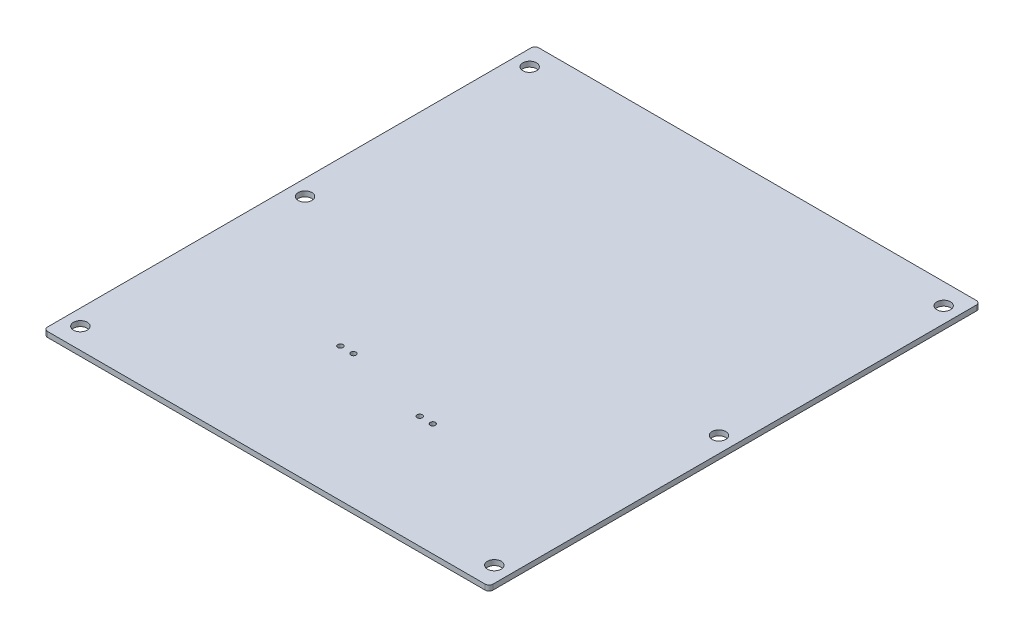
ISO-10303-21;
HEADER;
FILE_DESCRIPTION(('STEP AP214'),'2;1');
FILE_NAME('part.step','',(''),(''),'','','');
FILE_SCHEMA(('AUTOMOTIVE_DESIGN { 1 0 10303 214 1 1 1 1 }'));
ENDSEC;
DATA;
#1=APPLICATION_CONTEXT('core data for automotive mechanical design processes');
#2=APPLICATION_PROTOCOL_DEFINITION('international standard','automotive_design',2000,#1);
#3=PRODUCT_CONTEXT('',#1,'mechanical');
#4=PRODUCT('Part','Part','',(#3));
#5=PRODUCT_RELATED_PRODUCT_CATEGORY('part','',(#4));
#6=PRODUCT_DEFINITION_FORMATION('','',#4);
#7=PRODUCT_DEFINITION_CONTEXT('part definition',#1,'design');
#8=PRODUCT_DEFINITION('design','',#6,#7);
#9=PRODUCT_DEFINITION_SHAPE('','',#8);
#10=(LENGTH_UNIT() NAMED_UNIT(*) SI_UNIT(.MILLI.,.METRE.));
#11=(NAMED_UNIT(*) PLANE_ANGLE_UNIT() SI_UNIT($,.RADIAN.));
#12=(NAMED_UNIT(*) SI_UNIT($,.STERADIAN.) SOLID_ANGLE_UNIT());
#13=UNCERTAINTY_MEASURE_WITH_UNIT(LENGTH_MEASURE(1.E-05),#10,'distance_accuracy_value','');
#14=(GEOMETRIC_REPRESENTATION_CONTEXT(3) GLOBAL_UNCERTAINTY_ASSIGNED_CONTEXT((#13)) GLOBAL_UNIT_ASSIGNED_CONTEXT((#10,
#11,#12)) REPRESENTATION_CONTEXT('',''));
#15=CARTESIAN_POINT('',(0.,0.,0.));
#16=DIRECTION('',(0.,0.,1.));
#17=DIRECTION('',(1.,0.,0.));
#18=AXIS2_PLACEMENT_3D('',#15,#16,#17);
#19=CARTESIAN_POINT('',(319.226041148513,4.,-107.292047617403));
#20=DIRECTION('',(0.,1.,0.));
#21=DIRECTION('',(0.,0.,1.));
#22=AXIS2_PLACEMENT_3D('',#19,#20,#21);
#23=PLANE('',#22);
#24=CARTESIAN_POINT('',(517.330184072689,4.,178.737413059714));
#25=DIRECTION('',(0.,1.,0.));
#26=DIRECTION('',(0.,0.,-1.));
#27=AXIS2_PLACEMENT_3D('',#24,#25,#26);
#28=CIRCLE('',#27,2.);
#29=CARTESIAN_POINT('',(517.330184072689,4.,176.737413059714));
#30=VERTEX_POINT('',#29);
#31=EDGE_CURVE('E224',#30,#30,#28,.T.);
#32=ORIENTED_EDGE('',*,*,#31,.F.);
#33=EDGE_LOOP('',(#32));
#34=FACE_BOUND('',#33,.T.);
#35=CARTESIAN_POINT('',(450.618955235083,4.,162.614244131011));
#36=DIRECTION('',(0.,1.,0.));
#37=DIRECTION('',(0.,0.,1.));
#38=AXIS2_PLACEMENT_3D('',#35,#36,#37);
#39=CIRCLE('',#38,2.);
#40=CARTESIAN_POINT('',(450.618955235083,4.,164.614244131011));
#41=VERTEX_POINT('',#40);
#42=EDGE_CURVE('E212',#41,#41,#39,.T.);
#43=ORIENTED_EDGE('',*,*,#42,.F.);
#44=EDGE_LOOP('',(#43));
#45=FACE_BOUND('',#44,.T.);
#46=CARTESIAN_POINT('',(328.226041148513,4.,248.707952382597));
#47=DIRECTION('',(0.,1.,0.));
#48=DIRECTION('',(0.,0.,-1.));
#49=AXIS2_PLACEMENT_3D('',#46,#47,#48);
#50=CIRCLE('',#49,5.25);
#51=CARTESIAN_POINT('',(328.226041148513,4.,243.457952382597));
#52=VERTEX_POINT('',#51);
#53=EDGE_CURVE('E200',#52,#52,#50,.T.);
#54=ORIENTED_EDGE('',*,*,#53,.F.);
#55=EDGE_LOOP('',(#54));
#56=FACE_BOUND('',#55,.T.);
#57=CARTESIAN_POINT('',(644.226041148513,4.,-94.2920476174031));
#58=DIRECTION('',(0.,1.,0.));
#59=DIRECTION('',(0.,0.,-1.));
#60=AXIS2_PLACEMENT_3D('',#57,#58,#59);
#61=CIRCLE('',#60,5.24999999999995);
#62=CARTESIAN_POINT('',(644.226041148513,4.,-99.542047617403));
#63=VERTEX_POINT('',#62);
#64=EDGE_CURVE('E188',#63,#63,#61,.T.);
#65=ORIENTED_EDGE('',*,*,#64,.F.);
#66=EDGE_LOOP('',(#65));
#67=FACE_BOUND('',#66,.T.);
#68=CARTESIAN_POINT('',(644.226041148513,4.,77.2079523825969));
#69=DIRECTION('',(0.,1.,0.));
#70=DIRECTION('',(0.,0.,-1.));
#71=AXIS2_PLACEMENT_3D('',#68,#69,#70);
#72=CIRCLE('',#71,5.24999999999995);
#73=CARTESIAN_POINT('',(644.226041148513,4.,71.9579523825969));
#74=VERTEX_POINT('',#73);
#75=EDGE_CURVE('E134',#74,#74,#72,.T.);
#76=ORIENTED_EDGE('',*,*,#75,.F.);
#77=EDGE_LOOP('',(#76));
#78=FACE_BOUND('',#77,.T.);
#79=CARTESIAN_POINT('',(319.226041148513,4.,-107.292047617403));
#80=DIRECTION('',(0.,1.,0.));
#81=DIRECTION('',(0.,0.,1.));
#82=AXIS2_PLACEMENT_3D('',#79,#80,#81);
#83=CIRCLE('',#82,3.);
#84=CARTESIAN_POINT('',(319.226041148513,4.,-110.292047617403));
#85=VERTEX_POINT('',#84);
#86=CARTESIAN_POINT('',(316.226041148513,4.,-107.292047617403));
#87=VERTEX_POINT('',#86);
#88=EDGE_CURVE('E145',#85,#87,#83,.T.);
#89=ORIENTED_EDGE('',*,*,#88,.T.);
#90=DIRECTION('',(0.,0.,1.));
#91=VECTOR('',#90,1.);
#92=CARTESIAN_POINT('',(316.226041148513,4.,-107.292047617403));
#93=LINE('',#92,#91);
#94=CARTESIAN_POINT('',(316.226041148513,4.,261.707952382597));
#95=VERTEX_POINT('',#94);
#96=EDGE_CURVE('E93',#87,#95,#93,.T.);
#97=ORIENTED_EDGE('',*,*,#96,.T.);
#98=CARTESIAN_POINT('',(319.226041148513,4.,261.707952382597));
#99=DIRECTION('',(0.,1.,0.));
#100=DIRECTION('',(0.,0.,1.));
#101=AXIS2_PLACEMENT_3D('',#98,#99,#100);
#102=CIRCLE('',#101,3.);
#103=CARTESIAN_POINT('',(319.226041148513,4.,264.707952382597));
#104=VERTEX_POINT('',#103);
#105=EDGE_CURVE('E160',#95,#104,#102,.T.);
#106=ORIENTED_EDGE('',*,*,#105,.T.);
#107=DIRECTION('',(1.,0.,0.));
#108=VECTOR('',#107,1.);
#109=CARTESIAN_POINT('',(319.226041148513,4.,264.707952382597));
#110=LINE('',#109,#108);
#111=CARTESIAN_POINT('',(653.226041148513,4.,264.707952382597));
#112=VERTEX_POINT('',#111);
#113=EDGE_CURVE('E173',#104,#112,#110,.T.);
#114=ORIENTED_EDGE('',*,*,#113,.T.);
#115=CARTESIAN_POINT('',(653.226041148513,4.,261.707952382597));
#116=DIRECTION('',(0.,1.,0.));
#117=DIRECTION('',(0.,0.,1.));
#118=AXIS2_PLACEMENT_3D('',#115,#116,#117);
#119=CIRCLE('',#118,3.);
#120=CARTESIAN_POINT('',(656.226041148513,4.,261.707952382597));
#121=VERTEX_POINT('',#120);
#122=EDGE_CURVE('E112',#112,#121,#119,.T.);
#123=ORIENTED_EDGE('',*,*,#122,.T.);
#124=DIRECTION('',(0.,0.,-1.));
#125=VECTOR('',#124,1.);
#126=CARTESIAN_POINT('',(656.226041148513,4.,261.707952382597));
#127=LINE('',#126,#125);
#128=CARTESIAN_POINT('',(656.226041148513,4.,-107.292047617403));
#129=VERTEX_POINT('',#128);
#130=EDGE_CURVE('E106',#121,#129,#127,.T.);
#131=ORIENTED_EDGE('',*,*,#130,.T.);
#132=CARTESIAN_POINT('',(653.226041148513,4.,-107.292047617403));
#133=DIRECTION('',(0.,1.,0.));
#134=DIRECTION('',(0.,0.,1.));
#135=AXIS2_PLACEMENT_3D('',#132,#133,#134);
#136=CIRCLE('',#135,3.);
#137=CARTESIAN_POINT('',(653.226041148513,4.,-110.292047617403));
#138=VERTEX_POINT('',#137);
#139=EDGE_CURVE('E110',#129,#138,#136,.T.);
#140=ORIENTED_EDGE('',*,*,#139,.T.);
#141=DIRECTION('',(-1.,0.,0.));
#142=VECTOR('',#141,1.);
#143=CARTESIAN_POINT('',(653.226041148513,4.,-110.292047617403));
#144=LINE('',#143,#142);
#145=EDGE_CURVE('E50',#138,#85,#144,.T.);
#146=ORIENTED_EDGE('',*,*,#145,.T.);
#147=EDGE_LOOP('',(#89,#97,#106,#114,#123,#131,#140,#146));
#148=FACE_BOUND('',#147,.T.);
#149=CARTESIAN_POINT('',(328.226041148513,4.,77.207952382597));
#150=DIRECTION('',(0.,1.,0.));
#151=DIRECTION('',(0.,0.,-1.));
#152=AXIS2_PLACEMENT_3D('',#149,#150,#151);
#153=CIRCLE('',#152,5.25);
#154=CARTESIAN_POINT('',(328.226041148513,4.,71.957952382597));
#155=VERTEX_POINT('',#154);
#156=EDGE_CURVE('E182',#155,#155,#153,.T.);
#157=ORIENTED_EDGE('',*,*,#156,.F.);
#158=EDGE_LOOP('',(#157));
#159=FACE_BOUND('',#158,.T.);
#160=CARTESIAN_POINT('',(328.226041148513,4.,-94.2920476174031));
#161=DIRECTION('',(0.,1.,0.));
#162=DIRECTION('',(0.,0.,-1.));
#163=AXIS2_PLACEMENT_3D('',#160,#161,#162);
#164=CIRCLE('',#163,5.25);
#165=CARTESIAN_POINT('',(328.226041148513,4.,-99.5420476174031));
#166=VERTEX_POINT('',#165);
#167=EDGE_CURVE('E194',#166,#166,#164,.T.);
#168=ORIENTED_EDGE('',*,*,#167,.F.);
#169=EDGE_LOOP('',(#168));
#170=FACE_BOUND('',#169,.T.);
#171=CARTESIAN_POINT('',(644.226041148513,4.,248.707952382597));
#172=DIRECTION('',(0.,1.,0.));
#173=DIRECTION('',(0.,0.,-1.));
#174=AXIS2_PLACEMENT_3D('',#171,#172,#173);
#175=CIRCLE('',#174,5.24999999999995);
#176=CARTESIAN_POINT('',(644.226041148513,4.,243.457952382597));
#177=VERTEX_POINT('',#176);
#178=EDGE_CURVE('E206',#177,#177,#175,.T.);
#179=ORIENTED_EDGE('',*,*,#178,.F.);
#180=EDGE_LOOP('',(#179));
#181=FACE_BOUND('',#180,.T.);
#182=CARTESIAN_POINT('',(440.618955235083,4.,162.614244131011));
#183=DIRECTION('',(0.,1.,0.));
#184=DIRECTION('',(0.,0.,1.));
#185=AXIS2_PLACEMENT_3D('',#182,#183,#184);
#186=CIRCLE('',#185,2.);
#187=CARTESIAN_POINT('',(440.618955235083,4.,164.614244131011));
#188=VERTEX_POINT('',#187);
#189=EDGE_CURVE('E218',#188,#188,#186,.T.);
#190=ORIENTED_EDGE('',*,*,#189,.F.);
#191=EDGE_LOOP('',(#190));
#192=FACE_BOUND('',#191,.T.);
#193=CARTESIAN_POINT('',(527.330184072689,4.,178.737413059714));
#194=DIRECTION('',(0.,1.,0.));
#195=DIRECTION('',(0.,0.,-1.));
#196=AXIS2_PLACEMENT_3D('',#193,#194,#195);
#197=CIRCLE('',#196,2.);
#198=CARTESIAN_POINT('',(527.330184072689,4.,176.737413059714));
#199=VERTEX_POINT('',#198);
#200=EDGE_CURVE('E230',#199,#199,#197,.T.);
#201=ORIENTED_EDGE('',*,*,#200,.F.);
#202=EDGE_LOOP('',(#201));
#203=FACE_BOUND('',#202,.T.);
#204=ADVANCED_FACE('F33',(#34,#45,#56,#67,#78,#148,#159,#170,#181,#192,#203),#23,.T.);
#205=CARTESIAN_POINT('',(319.226041148513,0.,-107.292047617403));
#206=DIRECTION('',(0.,1.,0.));
#207=DIRECTION('',(0.,0.,1.));
#208=AXIS2_PLACEMENT_3D('',#205,#206,#207);
#209=PLANE('',#208);
#210=CARTESIAN_POINT('',(319.226041148513,0.,-107.292047617403));
#211=DIRECTION('',(0.,1.,0.));
#212=DIRECTION('',(0.,0.,1.));
#213=AXIS2_PLACEMENT_3D('',#210,#211,#212);
#214=CIRCLE('',#213,3.);
#215=CARTESIAN_POINT('',(319.226041148513,0.,-110.292047617403));
#216=VERTEX_POINT('',#215);
#217=CARTESIAN_POINT('',(316.226041148513,0.,-107.292047617403));
#218=VERTEX_POINT('',#217);
#219=EDGE_CURVE('E130',#216,#218,#214,.T.);
#220=ORIENTED_EDGE('',*,*,#219,.F.);
#221=DIRECTION('',(-1.,0.,0.));
#222=VECTOR('',#221,1.);
#223=CARTESIAN_POINT('',(653.226041148513,0.,-110.292047617403));
#224=LINE('',#223,#222);
#225=CARTESIAN_POINT('',(653.226041148513,0.,-110.292047617403));
#226=VERTEX_POINT('',#225);
#227=EDGE_CURVE('E85',#226,#216,#224,.T.);
#228=ORIENTED_EDGE('',*,*,#227,.F.);
#229=CARTESIAN_POINT('',(653.226041148513,0.,-107.292047617403));
#230=DIRECTION('',(0.,1.,0.));
#231=DIRECTION('',(0.,0.,1.));
#232=AXIS2_PLACEMENT_3D('',#229,#230,#231);
#233=CIRCLE('',#232,3.);
#234=CARTESIAN_POINT('',(656.226041148513,0.,-107.292047617403));
#235=VERTEX_POINT('',#234);
#236=EDGE_CURVE('E79',#235,#226,#233,.T.);
#237=ORIENTED_EDGE('',*,*,#236,.F.);
#238=DIRECTION('',(0.,0.,-1.));
#239=VECTOR('',#238,1.);
#240=CARTESIAN_POINT('',(656.226041148513,0.,261.707952382597));
#241=LINE('',#240,#239);
#242=CARTESIAN_POINT('',(656.226041148513,0.,261.707952382597));
#243=VERTEX_POINT('',#242);
#244=EDGE_CURVE('E120',#243,#235,#241,.T.);
#245=ORIENTED_EDGE('',*,*,#244,.F.);
#246=CARTESIAN_POINT('',(653.226041148513,0.,261.707952382597));
#247=DIRECTION('',(0.,1.,0.));
#248=DIRECTION('',(0.,0.,1.));
#249=AXIS2_PLACEMENT_3D('',#246,#247,#248);
#250=CIRCLE('',#249,3.);
#251=CARTESIAN_POINT('',(653.226041148513,0.,264.707952382597));
#252=VERTEX_POINT('',#251);
#253=EDGE_CURVE('E140',#252,#243,#250,.T.);
#254=ORIENTED_EDGE('',*,*,#253,.F.);
#255=DIRECTION('',(1.,0.,0.));
#256=VECTOR('',#255,1.);
#257=CARTESIAN_POINT('',(319.226041148513,0.,264.707952382597));
#258=LINE('',#257,#256);
#259=CARTESIAN_POINT('',(319.226041148513,0.,264.707952382597));
#260=VERTEX_POINT('',#259);
#261=EDGE_CURVE('E138',#260,#252,#258,.T.);
#262=ORIENTED_EDGE('',*,*,#261,.F.);
#263=CARTESIAN_POINT('',(319.226041148513,0.,261.707952382597));
#264=DIRECTION('',(0.,1.,0.));
#265=DIRECTION('',(0.,0.,1.));
#266=AXIS2_PLACEMENT_3D('',#263,#264,#265);
#267=CIRCLE('',#266,3.);
#268=CARTESIAN_POINT('',(316.226041148513,0.,261.707952382597));
#269=VERTEX_POINT('',#268);
#270=EDGE_CURVE('E136',#269,#260,#267,.T.);
#271=ORIENTED_EDGE('',*,*,#270,.F.);
#272=DIRECTION('',(0.,0.,1.));
#273=VECTOR('',#272,1.);
#274=CARTESIAN_POINT('',(316.226041148513,0.,-107.292047617403));
#275=LINE('',#274,#273);
#276=EDGE_CURVE('E133',#218,#269,#275,.T.);
#277=ORIENTED_EDGE('',*,*,#276,.F.);
#278=EDGE_LOOP('',(#220,#228,#237,#245,#254,#262,#271,#277));
#279=FACE_BOUND('',#278,.T.);
#280=CARTESIAN_POINT('',(644.226041148513,0.,77.2079523825969));
#281=DIRECTION('',(0.,1.,0.));
#282=DIRECTION('',(0.,0.,-1.));
#283=AXIS2_PLACEMENT_3D('',#280,#281,#282);
#284=CIRCLE('',#283,5.24999999999995);
#285=CARTESIAN_POINT('',(644.226041148513,0.,71.9579523825969));
#286=VERTEX_POINT('',#285);
#287=EDGE_CURVE('E179',#286,#286,#284,.T.);
#288=ORIENTED_EDGE('',*,*,#287,.T.);
#289=EDGE_LOOP('',(#288));
#290=FACE_BOUND('',#289,.T.);
#291=CARTESIAN_POINT('',(328.226041148513,0.,77.207952382597));
#292=DIRECTION('',(0.,1.,0.));
#293=DIRECTION('',(0.,0.,-1.));
#294=AXIS2_PLACEMENT_3D('',#291,#292,#293);
#295=CIRCLE('',#294,5.25);
#296=CARTESIAN_POINT('',(328.226041148513,0.,71.957952382597));
#297=VERTEX_POINT('',#296);
#298=EDGE_CURVE('E185',#297,#297,#295,.T.);
#299=ORIENTED_EDGE('',*,*,#298,.T.);
#300=EDGE_LOOP('',(#299));
#301=FACE_BOUND('',#300,.T.);
#302=CARTESIAN_POINT('',(644.226041148513,0.,-94.2920476174031));
#303=DIRECTION('',(0.,1.,0.));
#304=DIRECTION('',(0.,0.,-1.));
#305=AXIS2_PLACEMENT_3D('',#302,#303,#304);
#306=CIRCLE('',#305,5.24999999999995);
#307=CARTESIAN_POINT('',(644.226041148513,0.,-99.542047617403));
#308=VERTEX_POINT('',#307);
#309=EDGE_CURVE('E191',#308,#308,#306,.T.);
#310=ORIENTED_EDGE('',*,*,#309,.T.);
#311=EDGE_LOOP('',(#310));
#312=FACE_BOUND('',#311,.T.);
#313=CARTESIAN_POINT('',(328.226041148513,0.,-94.2920476174031));
#314=DIRECTION('',(0.,1.,0.));
#315=DIRECTION('',(0.,0.,-1.));
#316=AXIS2_PLACEMENT_3D('',#313,#314,#315);
#317=CIRCLE('',#316,5.25);
#318=CARTESIAN_POINT('',(328.226041148513,0.,-99.5420476174031));
#319=VERTEX_POINT('',#318);
#320=EDGE_CURVE('E197',#319,#319,#317,.T.);
#321=ORIENTED_EDGE('',*,*,#320,.T.);
#322=EDGE_LOOP('',(#321));
#323=FACE_BOUND('',#322,.T.);
#324=CARTESIAN_POINT('',(328.226041148513,0.,248.707952382597));
#325=DIRECTION('',(0.,1.,0.));
#326=DIRECTION('',(0.,0.,-1.));
#327=AXIS2_PLACEMENT_3D('',#324,#325,#326);
#328=CIRCLE('',#327,5.25);
#329=CARTESIAN_POINT('',(328.226041148513,0.,243.457952382597));
#330=VERTEX_POINT('',#329);
#331=EDGE_CURVE('E203',#330,#330,#328,.T.);
#332=ORIENTED_EDGE('',*,*,#331,.T.);
#333=EDGE_LOOP('',(#332));
#334=FACE_BOUND('',#333,.T.);
#335=CARTESIAN_POINT('',(644.226041148513,0.,248.707952382597));
#336=DIRECTION('',(0.,1.,0.));
#337=DIRECTION('',(0.,0.,-1.));
#338=AXIS2_PLACEMENT_3D('',#335,#336,#337);
#339=CIRCLE('',#338,5.24999999999995);
#340=CARTESIAN_POINT('',(644.226041148513,0.,243.457952382597));
#341=VERTEX_POINT('',#340);
#342=EDGE_CURVE('E209',#341,#341,#339,.T.);
#343=ORIENTED_EDGE('',*,*,#342,.T.);
#344=EDGE_LOOP('',(#343));
#345=FACE_BOUND('',#344,.T.);
#346=CARTESIAN_POINT('',(450.618955235083,0.,162.614244131011));
#347=DIRECTION('',(0.,1.,0.));
#348=DIRECTION('',(0.,0.,1.));
#349=AXIS2_PLACEMENT_3D('',#346,#347,#348);
#350=CIRCLE('',#349,2.);
#351=CARTESIAN_POINT('',(450.618955235083,0.,164.614244131011));
#352=VERTEX_POINT('',#351);
#353=EDGE_CURVE('E215',#352,#352,#350,.T.);
#354=ORIENTED_EDGE('',*,*,#353,.T.);
#355=EDGE_LOOP('',(#354));
#356=FACE_BOUND('',#355,.T.);
#357=CARTESIAN_POINT('',(440.618955235083,0.,162.614244131011));
#358=DIRECTION('',(0.,1.,0.));
#359=DIRECTION('',(0.,0.,1.));
#360=AXIS2_PLACEMENT_3D('',#357,#358,#359);
#361=CIRCLE('',#360,2.);
#362=CARTESIAN_POINT('',(440.618955235083,0.,164.614244131011));
#363=VERTEX_POINT('',#362);
#364=EDGE_CURVE('E221',#363,#363,#361,.T.);
#365=ORIENTED_EDGE('',*,*,#364,.T.);
#366=EDGE_LOOP('',(#365));
#367=FACE_BOUND('',#366,.T.);
#368=CARTESIAN_POINT('',(517.330184072689,0.,178.737413059714));
#369=DIRECTION('',(0.,1.,0.));
#370=DIRECTION('',(0.,0.,-1.));
#371=AXIS2_PLACEMENT_3D('',#368,#369,#370);
#372=CIRCLE('',#371,2.);
#373=CARTESIAN_POINT('',(517.330184072689,0.,176.737413059714));
#374=VERTEX_POINT('',#373);
#375=EDGE_CURVE('E227',#374,#374,#372,.T.);
#376=ORIENTED_EDGE('',*,*,#375,.T.);
#377=EDGE_LOOP('',(#376));
#378=FACE_BOUND('',#377,.T.);
#379=CARTESIAN_POINT('',(527.330184072689,0.,178.737413059714));
#380=DIRECTION('',(0.,1.,0.));
#381=DIRECTION('',(0.,0.,-1.));
#382=AXIS2_PLACEMENT_3D('',#379,#380,#381);
#383=CIRCLE('',#382,2.);
#384=CARTESIAN_POINT('',(527.330184072689,0.,176.737413059714));
#385=VERTEX_POINT('',#384);
#386=EDGE_CURVE('E233',#385,#385,#383,.T.);
#387=ORIENTED_EDGE('',*,*,#386,.T.);
#388=EDGE_LOOP('',(#387));
#389=FACE_BOUND('',#388,.T.);
#390=ADVANCED_FACE('F164',(#279,#290,#301,#312,#323,#334,#345,#356,#367,#378,#389),#209,.F.);
#391=CARTESIAN_POINT('',(319.226041148513,4.,-107.292047617403));
#392=DIRECTION('',(0.,-1.,0.));
#393=DIRECTION('',(0.,0.,-1.));
#394=AXIS2_PLACEMENT_3D('',#391,#392,#393);
#395=CYLINDRICAL_SURFACE('',#394,3.);
#396=ORIENTED_EDGE('',*,*,#219,.T.);
#397=DIRECTION('',(0.,-1.,0.));
#398=VECTOR('',#397,1.);
#399=CARTESIAN_POINT('',(316.226041148513,4.,-107.292047617403));
#400=LINE('',#399,#398);
#401=EDGE_CURVE('E11',#87,#218,#400,.T.);
#402=ORIENTED_EDGE('',*,*,#401,.F.);
#403=ORIENTED_EDGE('',*,*,#88,.F.);
#404=DIRECTION('',(0.,-1.,0.));
#405=VECTOR('',#404,1.);
#406=CARTESIAN_POINT('',(319.226041148513,4.,-110.292047617403));
#407=LINE('',#406,#405);
#408=EDGE_CURVE('E126',#85,#216,#407,.T.);
#409=ORIENTED_EDGE('',*,*,#408,.T.);
#410=EDGE_LOOP('',(#396,#402,#403,#409));
#411=FACE_BOUND('',#410,.T.);
#412=ADVANCED_FACE('F35',(#411),#395,.T.);
#413=CARTESIAN_POINT('',(316.226041148513,4.,-107.292047617403));
#414=DIRECTION('',(1.,0.,0.));
#415=DIRECTION('',(0.,0.,-1.));
#416=AXIS2_PLACEMENT_3D('',#413,#414,#415);
#417=PLANE('',#416);
#418=ORIENTED_EDGE('',*,*,#276,.T.);
#419=DIRECTION('',(0.,-1.,0.));
#420=VECTOR('',#419,1.);
#421=CARTESIAN_POINT('',(316.226041148513,4.,261.707952382597));
#422=LINE('',#421,#420);
#423=EDGE_CURVE('E42',#95,#269,#422,.T.);
#424=ORIENTED_EDGE('',*,*,#423,.F.);
#425=ORIENTED_EDGE('',*,*,#96,.F.);
#426=ORIENTED_EDGE('',*,*,#401,.T.);
#427=EDGE_LOOP('',(#418,#424,#425,#426));
#428=FACE_BOUND('',#427,.T.);
#429=ADVANCED_FACE('F267',(#428),#417,.F.);
#430=CARTESIAN_POINT('',(319.226041148513,4.,261.707952382597));
#431=DIRECTION('',(0.,-1.,0.));
#432=DIRECTION('',(0.,0.,-1.));
#433=AXIS2_PLACEMENT_3D('',#430,#431,#432);
#434=CYLINDRICAL_SURFACE('',#433,3.);
#435=ORIENTED_EDGE('',*,*,#270,.T.);
#436=DIRECTION('',(0.,-1.,0.));
#437=VECTOR('',#436,1.);
#438=CARTESIAN_POINT('',(319.226041148513,4.,264.707952382597));
#439=LINE('',#438,#437);
#440=EDGE_CURVE('E152',#104,#260,#439,.T.);
#441=ORIENTED_EDGE('',*,*,#440,.F.);
#442=ORIENTED_EDGE('',*,*,#105,.F.);
#443=ORIENTED_EDGE('',*,*,#423,.T.);
#444=EDGE_LOOP('',(#435,#441,#442,#443));
#445=FACE_BOUND('',#444,.T.);
#446=ADVANCED_FACE('F158',(#445),#434,.T.);
#447=CARTESIAN_POINT('',(319.226041148513,4.,264.707952382597));
#448=DIRECTION('',(0.,0.,-1.));
#449=DIRECTION('',(-1.,0.,0.));
#450=AXIS2_PLACEMENT_3D('',#447,#448,#449);
#451=PLANE('',#450);
#452=ORIENTED_EDGE('',*,*,#261,.T.);
#453=DIRECTION('',(0.,-1.,0.));
#454=VECTOR('',#453,1.);
#455=CARTESIAN_POINT('',(653.226041148513,4.,264.707952382597));
#456=LINE('',#455,#454);
#457=EDGE_CURVE('E149',#112,#252,#456,.T.);
#458=ORIENTED_EDGE('',*,*,#457,.F.);
#459=ORIENTED_EDGE('',*,*,#113,.F.);
#460=ORIENTED_EDGE('',*,*,#440,.T.);
#461=EDGE_LOOP('',(#452,#458,#459,#460));
#462=FACE_BOUND('',#461,.T.);
#463=ADVANCED_FACE('F169',(#462),#451,.F.);
#464=CARTESIAN_POINT('',(653.226041148513,4.,261.707952382597));
#465=DIRECTION('',(0.,-1.,0.));
#466=DIRECTION('',(0.,0.,-1.));
#467=AXIS2_PLACEMENT_3D('',#464,#465,#466);
#468=CYLINDRICAL_SURFACE('',#467,3.);
#469=ORIENTED_EDGE('',*,*,#253,.T.);
#470=DIRECTION('',(0.,-1.,0.));
#471=VECTOR('',#470,1.);
#472=CARTESIAN_POINT('',(656.226041148513,4.,261.707952382597));
#473=LINE('',#472,#471);
#474=EDGE_CURVE('E121',#121,#243,#473,.T.);
#475=ORIENTED_EDGE('',*,*,#474,.F.);
#476=ORIENTED_EDGE('',*,*,#122,.F.);
#477=ORIENTED_EDGE('',*,*,#457,.T.);
#478=EDGE_LOOP('',(#469,#475,#476,#477));
#479=FACE_BOUND('',#478,.T.);
#480=ADVANCED_FACE('F172',(#479),#468,.T.);
#481=CARTESIAN_POINT('',(656.226041148513,4.,261.707952382597));
#482=DIRECTION('',(-1.,0.,0.));
#483=DIRECTION('',(0.,0.,1.));
#484=AXIS2_PLACEMENT_3D('',#481,#482,#483);
#485=PLANE('',#484);
#486=ORIENTED_EDGE('',*,*,#244,.T.);
#487=DIRECTION('',(0.,-1.,0.));
#488=VECTOR('',#487,1.);
#489=CARTESIAN_POINT('',(656.226041148513,4.,-107.292047617403));
#490=LINE('',#489,#488);
#491=EDGE_CURVE('E117',#129,#235,#490,.T.);
#492=ORIENTED_EDGE('',*,*,#491,.F.);
#493=ORIENTED_EDGE('',*,*,#130,.F.);
#494=ORIENTED_EDGE('',*,*,#474,.T.);
#495=EDGE_LOOP('',(#486,#492,#493,#494));
#496=FACE_BOUND('',#495,.T.);
#497=ADVANCED_FACE('F118',(#496),#485,.F.);
#498=CARTESIAN_POINT('',(653.226041148513,4.,-107.292047617403));
#499=DIRECTION('',(0.,-1.,0.));
#500=DIRECTION('',(0.,0.,-1.));
#501=AXIS2_PLACEMENT_3D('',#498,#499,#500);
#502=CYLINDRICAL_SURFACE('',#501,3.);
#503=ORIENTED_EDGE('',*,*,#236,.T.);
#504=DIRECTION('',(0.,-1.,0.));
#505=VECTOR('',#504,1.);
#506=CARTESIAN_POINT('',(653.226041148513,4.,-110.292047617403));
#507=LINE('',#506,#505);
#508=EDGE_CURVE('E122',#138,#226,#507,.T.);
#509=ORIENTED_EDGE('',*,*,#508,.F.);
#510=ORIENTED_EDGE('',*,*,#139,.F.);
#511=ORIENTED_EDGE('',*,*,#491,.T.);
#512=EDGE_LOOP('',(#503,#509,#510,#511));
#513=FACE_BOUND('',#512,.T.);
#514=ADVANCED_FACE('F124',(#513),#502,.T.);
#515=CARTESIAN_POINT('',(653.226041148513,4.,-110.292047617403));
#516=DIRECTION('',(0.,0.,1.));
#517=DIRECTION('',(1.,0.,0.));
#518=AXIS2_PLACEMENT_3D('',#515,#516,#517);
#519=PLANE('',#518);
#520=ORIENTED_EDGE('',*,*,#227,.T.);
#521=ORIENTED_EDGE('',*,*,#408,.F.);
#522=ORIENTED_EDGE('',*,*,#145,.F.);
#523=ORIENTED_EDGE('',*,*,#508,.T.);
#524=EDGE_LOOP('',(#520,#521,#522,#523));
#525=FACE_BOUND('',#524,.T.);
#526=ADVANCED_FACE('F255',(#525),#519,.F.);
#527=CARTESIAN_POINT('',(644.226041148513,4.,77.2079523825969));
#528=DIRECTION('',(0.,-1.,0.));
#529=DIRECTION('',(0.,0.,-1.));
#530=AXIS2_PLACEMENT_3D('',#527,#528,#529);
#531=CYLINDRICAL_SURFACE('',#530,5.24999999999995);
#532=ORIENTED_EDGE('',*,*,#75,.T.);
#533=EDGE_LOOP('',(#532));
#534=FACE_BOUND('',#533,.T.);
#535=ORIENTED_EDGE('',*,*,#287,.F.);
#536=EDGE_LOOP('',(#535));
#537=FACE_BOUND('',#536,.T.);
#538=ADVANCED_FACE('F252',(#534,#537),#531,.F.);
#539=CARTESIAN_POINT('',(328.226041148513,4.,77.207952382597));
#540=DIRECTION('',(0.,-1.,0.));
#541=DIRECTION('',(0.,0.,-1.));
#542=AXIS2_PLACEMENT_3D('',#539,#540,#541);
#543=CYLINDRICAL_SURFACE('',#542,5.25);
#544=ORIENTED_EDGE('',*,*,#156,.T.);
#545=EDGE_LOOP('',(#544));
#546=FACE_BOUND('',#545,.T.);
#547=ORIENTED_EDGE('',*,*,#298,.F.);
#548=EDGE_LOOP('',(#547));
#549=FACE_BOUND('',#548,.T.);
#550=ADVANCED_FACE('F331',(#546,#549),#543,.F.);
#551=CARTESIAN_POINT('',(644.226041148513,4.,-94.2920476174031));
#552=DIRECTION('',(0.,-1.,0.));
#553=DIRECTION('',(0.,0.,-1.));
#554=AXIS2_PLACEMENT_3D('',#551,#552,#553);
#555=CYLINDRICAL_SURFACE('',#554,5.24999999999995);
#556=ORIENTED_EDGE('',*,*,#64,.T.);
#557=EDGE_LOOP('',(#556));
#558=FACE_BOUND('',#557,.T.);
#559=ORIENTED_EDGE('',*,*,#309,.F.);
#560=EDGE_LOOP('',(#559));
#561=FACE_BOUND('',#560,.T.);
#562=ADVANCED_FACE('F339',(#558,#561),#555,.F.);
#563=CARTESIAN_POINT('',(328.226041148513,4.,-94.2920476174031));
#564=DIRECTION('',(0.,-1.,0.));
#565=DIRECTION('',(0.,0.,-1.));
#566=AXIS2_PLACEMENT_3D('',#563,#564,#565);
#567=CYLINDRICAL_SURFACE('',#566,5.25);
#568=ORIENTED_EDGE('',*,*,#167,.T.);
#569=EDGE_LOOP('',(#568));
#570=FACE_BOUND('',#569,.T.);
#571=ORIENTED_EDGE('',*,*,#320,.F.);
#572=EDGE_LOOP('',(#571));
#573=FACE_BOUND('',#572,.T.);
#574=ADVANCED_FACE('F347',(#570,#573),#567,.F.);
#575=CARTESIAN_POINT('',(328.226041148513,4.,248.707952382597));
#576=DIRECTION('',(0.,-1.,0.));
#577=DIRECTION('',(0.,0.,-1.));
#578=AXIS2_PLACEMENT_3D('',#575,#576,#577);
#579=CYLINDRICAL_SURFACE('',#578,5.25);
#580=ORIENTED_EDGE('',*,*,#53,.T.);
#581=EDGE_LOOP('',(#580));
#582=FACE_BOUND('',#581,.T.);
#583=ORIENTED_EDGE('',*,*,#331,.F.);
#584=EDGE_LOOP('',(#583));
#585=FACE_BOUND('',#584,.T.);
#586=ADVANCED_FACE('F356',(#582,#585),#579,.F.);
#587=CARTESIAN_POINT('',(644.226041148513,4.,248.707952382597));
#588=DIRECTION('',(0.,-1.,0.));
#589=DIRECTION('',(0.,0.,-1.));
#590=AXIS2_PLACEMENT_3D('',#587,#588,#589);
#591=CYLINDRICAL_SURFACE('',#590,5.24999999999995);
#592=ORIENTED_EDGE('',*,*,#178,.T.);
#593=EDGE_LOOP('',(#592));
#594=FACE_BOUND('',#593,.T.);
#595=ORIENTED_EDGE('',*,*,#342,.F.);
#596=EDGE_LOOP('',(#595));
#597=FACE_BOUND('',#596,.T.);
#598=ADVANCED_FACE('F365',(#594,#597),#591,.F.);
#599=CARTESIAN_POINT('',(450.618955235083,4.,162.614244131011));
#600=DIRECTION('',(0.,-1.,0.));
#601=DIRECTION('',(0.,0.,-1.));
#602=AXIS2_PLACEMENT_3D('',#599,#600,#601);
#603=CYLINDRICAL_SURFACE('',#602,2.);
#604=ORIENTED_EDGE('',*,*,#42,.T.);
#605=EDGE_LOOP('',(#604));
#606=FACE_BOUND('',#605,.T.);
#607=ORIENTED_EDGE('',*,*,#353,.F.);
#608=EDGE_LOOP('',(#607));
#609=FACE_BOUND('',#608,.T.);
#610=ADVANCED_FACE('F374',(#606,#609),#603,.F.);
#611=CARTESIAN_POINT('',(440.618955235083,4.,162.614244131011));
#612=DIRECTION('',(0.,-1.,0.));
#613=DIRECTION('',(0.,0.,-1.));
#614=AXIS2_PLACEMENT_3D('',#611,#612,#613);
#615=CYLINDRICAL_SURFACE('',#614,2.);
#616=ORIENTED_EDGE('',*,*,#189,.T.);
#617=EDGE_LOOP('',(#616));
#618=FACE_BOUND('',#617,.T.);
#619=ORIENTED_EDGE('',*,*,#364,.F.);
#620=EDGE_LOOP('',(#619));
#621=FACE_BOUND('',#620,.T.);
#622=ADVANCED_FACE('F383',(#618,#621),#615,.F.);
#623=CARTESIAN_POINT('',(517.330184072689,4.,178.737413059714));
#624=DIRECTION('',(0.,-1.,0.));
#625=DIRECTION('',(0.,0.,-1.));
#626=AXIS2_PLACEMENT_3D('',#623,#624,#625);
#627=CYLINDRICAL_SURFACE('',#626,2.);
#628=ORIENTED_EDGE('',*,*,#31,.T.);
#629=EDGE_LOOP('',(#628));
#630=FACE_BOUND('',#629,.T.);
#631=ORIENTED_EDGE('',*,*,#375,.F.);
#632=EDGE_LOOP('',(#631));
#633=FACE_BOUND('',#632,.T.);
#634=ADVANCED_FACE('F392',(#630,#633),#627,.F.);
#635=CARTESIAN_POINT('',(527.330184072689,4.,178.737413059714));
#636=DIRECTION('',(0.,-1.,0.));
#637=DIRECTION('',(0.,0.,-1.));
#638=AXIS2_PLACEMENT_3D('',#635,#636,#637);
#639=CYLINDRICAL_SURFACE('',#638,2.);
#640=ORIENTED_EDGE('',*,*,#200,.T.);
#641=EDGE_LOOP('',(#640));
#642=FACE_BOUND('',#641,.T.);
#643=ORIENTED_EDGE('',*,*,#386,.F.);
#644=EDGE_LOOP('',(#643));
#645=FACE_BOUND('',#644,.T.);
#646=ADVANCED_FACE('F239',(#642,#645),#639,.F.);
#647=CLOSED_SHELL('',(#204,#390,#412,#429,#446,#463,#480,#497,#514,#526,#538,#550,#562,#574,
#586,#598,#610,#622,#634,#646));
#648=MANIFOLD_SOLID_BREP('B2',#647);
#649=ADVANCED_BREP_SHAPE_REPRESENTATION('',(#18,#648),#14);
#650=SHAPE_DEFINITION_REPRESENTATION(#9,#649);
ENDSEC;
END-ISO-10303-21;
